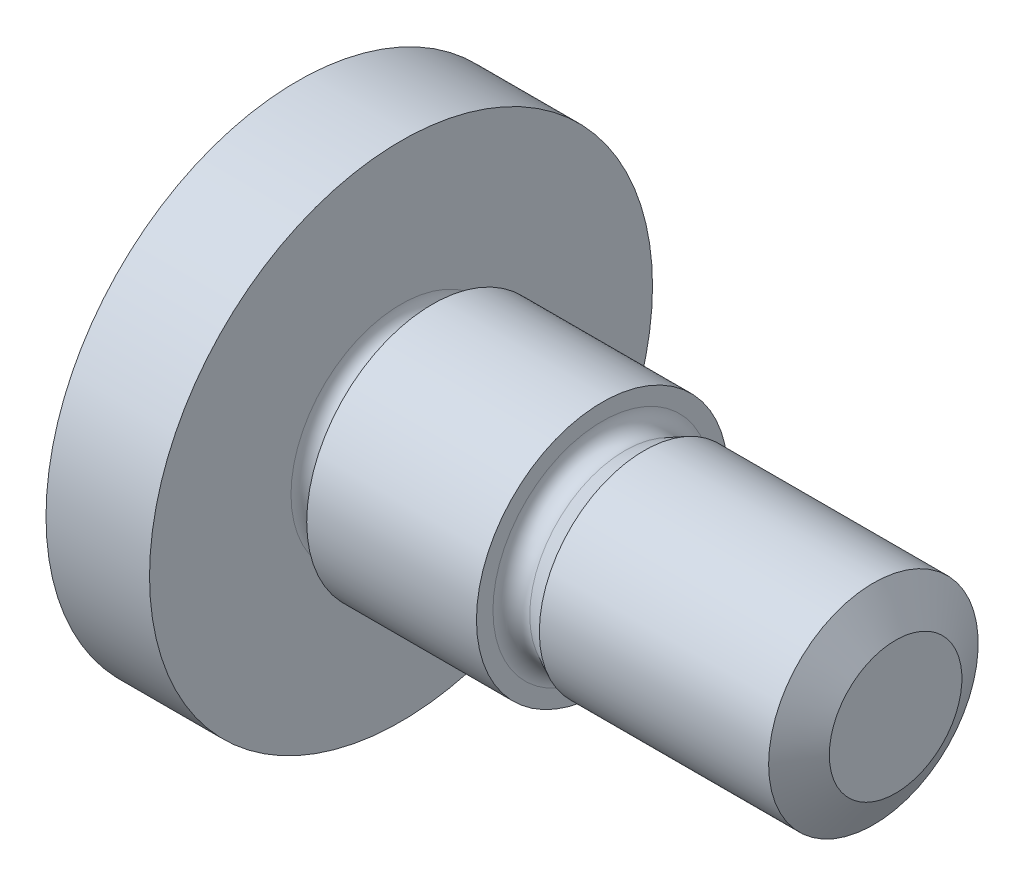
ISO-10303-21;
HEADER;
FILE_DESCRIPTION(('STEP AP214'),'2;1');
FILE_NAME('part.step','',(''),(''),'','','');
FILE_SCHEMA(('AUTOMOTIVE_DESIGN { 1 0 10303 214 1 1 1 1 }'));
ENDSEC;
DATA;
#1=APPLICATION_CONTEXT('core data for automotive mechanical design processes');
#2=APPLICATION_PROTOCOL_DEFINITION('international standard','automotive_design',2000,#1);
#3=PRODUCT_CONTEXT('',#1,'mechanical');
#4=PRODUCT('Part','Part','',(#3));
#5=PRODUCT_RELATED_PRODUCT_CATEGORY('part','',(#4));
#6=PRODUCT_DEFINITION_FORMATION('','',#4);
#7=PRODUCT_DEFINITION_CONTEXT('part definition',#1,'design');
#8=PRODUCT_DEFINITION('design','',#6,#7);
#9=PRODUCT_DEFINITION_SHAPE('','',#8);
#10=(LENGTH_UNIT() NAMED_UNIT(*) SI_UNIT(.MILLI.,.METRE.));
#11=(NAMED_UNIT(*) PLANE_ANGLE_UNIT() SI_UNIT($,.RADIAN.));
#12=(NAMED_UNIT(*) SI_UNIT($,.STERADIAN.) SOLID_ANGLE_UNIT());
#13=UNCERTAINTY_MEASURE_WITH_UNIT(LENGTH_MEASURE(1.E-05),#10,'distance_accuracy_value','');
#14=(GEOMETRIC_REPRESENTATION_CONTEXT(3) GLOBAL_UNCERTAINTY_ASSIGNED_CONTEXT((#13)) GLOBAL_UNIT_ASSIGNED_CONTEXT((#10,
#11,#12)) REPRESENTATION_CONTEXT('',''));
#15=CARTESIAN_POINT('',(0.,0.,0.));
#16=DIRECTION('',(0.,0.,1.));
#17=DIRECTION('',(1.,0.,0.));
#18=AXIS2_PLACEMENT_3D('',#15,#16,#17);
#19=CARTESIAN_POINT('',(0.,0.,0.));
#20=DIRECTION('',(1.,0.,0.));
#21=DIRECTION('',(0.,0.,-1.));
#22=AXIS2_PLACEMENT_3D('',#19,#20,#21);
#23=PLANE('',#22);
#24=DIRECTION('',(0.,0.5,0.866025403784439));
#25=VECTOR('',#24,1.);
#26=CARTESIAN_POINT('',(0.,-1.73205080756888,0.));
#27=LINE('',#26,#25);
#28=CARTESIAN_POINT('',(0.,-1.73205080756888,0.));
#29=VERTEX_POINT('',#28);
#30=CARTESIAN_POINT('',(0.,-0.866025403784439,1.5));
#31=VERTEX_POINT('',#30);
#32=EDGE_CURVE('E198',#29,#31,#27,.T.);
#33=ORIENTED_EDGE('',*,*,#32,.F.);
#34=DIRECTION('',(0.,-0.5,0.866025403784439));
#35=VECTOR('',#34,1.);
#36=CARTESIAN_POINT('',(0.,-0.866025403784438,-1.5));
#37=LINE('',#36,#35);
#38=CARTESIAN_POINT('',(0.,-0.866025403784438,-1.5));
#39=VERTEX_POINT('',#38);
#40=EDGE_CURVE('E50',#39,#29,#37,.T.);
#41=ORIENTED_EDGE('',*,*,#40,.F.);
#42=DIRECTION('',(0.,-1.,0.));
#43=VECTOR('',#42,1.);
#44=CARTESIAN_POINT('',(0.,0.86602540378444,-1.5));
#45=LINE('',#44,#43);
#46=CARTESIAN_POINT('',(0.,0.86602540378444,-1.5));
#47=VERTEX_POINT('',#46);
#48=EDGE_CURVE('E85',#47,#39,#45,.T.);
#49=ORIENTED_EDGE('',*,*,#48,.F.);
#50=DIRECTION('',(0.,-0.5,-0.866025403784439));
#51=VECTOR('',#50,1.);
#52=CARTESIAN_POINT('',(0.,1.73205080756888,0.));
#53=LINE('',#52,#51);
#54=CARTESIAN_POINT('',(0.,1.73205080756888,0.));
#55=VERTEX_POINT('',#54);
#56=EDGE_CURVE('E94',#55,#47,#53,.T.);
#57=ORIENTED_EDGE('',*,*,#56,.F.);
#58=DIRECTION('',(0.,0.5,-0.866025403784439));
#59=VECTOR('',#58,1.);
#60=CARTESIAN_POINT('',(0.,0.86602540378444,1.5));
#61=LINE('',#60,#59);
#62=CARTESIAN_POINT('',(0.,0.86602540378444,1.5));
#63=VERTEX_POINT('',#62);
#64=EDGE_CURVE('E100',#63,#55,#61,.T.);
#65=ORIENTED_EDGE('',*,*,#64,.F.);
#66=DIRECTION('',(0.,1.,0.));
#67=VECTOR('',#66,1.);
#68=CARTESIAN_POINT('',(0.,-0.866025403784439,1.5));
#69=LINE('',#68,#67);
#70=EDGE_CURVE('E231',#31,#63,#69,.T.);
#71=ORIENTED_EDGE('',*,*,#70,.F.);
#72=EDGE_LOOP('',(#33,#41,#49,#57,#65,#71));
#73=FACE_BOUND('',#72,.T.);
#74=CARTESIAN_POINT('',(0.,0.,0.));
#75=DIRECTION('',(-1.,0.,0.));
#76=DIRECTION('',(0.,0.,1.));
#77=AXIS2_PLACEMENT_3D('',#74,#75,#76);
#78=CIRCLE('',#77,5.0820130719885);
#79=CARTESIAN_POINT('',(0.,0.,5.0820130719885));
#80=VERTEX_POINT('',#79);
#81=EDGE_CURVE('E140',#80,#80,#78,.T.);
#82=ORIENTED_EDGE('',*,*,#81,.T.);
#83=EDGE_LOOP('',(#82));
#84=FACE_BOUND('',#83,.T.);
#85=ADVANCED_FACE('F34',(#73,#84),#23,.F.);
#86=CARTESIAN_POINT('',(0.53,0.,0.));
#87=DIRECTION('',(1.,0.,0.));
#88=DIRECTION('',(0.,0.,-1.));
#89=AXIS2_PLACEMENT_3D('',#86,#87,#88);
#90=CONICAL_SURFACE('',#89,6.,1.0471975511966);
#91=ORIENTED_EDGE('',*,*,#81,.F.);
#92=EDGE_LOOP('',(#91));
#93=FACE_BOUND('',#92,.T.);
#94=CARTESIAN_POINT('',(0.53,0.,0.));
#95=DIRECTION('',(-1.,0.,0.));
#96=DIRECTION('',(0.,0.,1.));
#97=AXIS2_PLACEMENT_3D('',#94,#95,#96);
#98=CIRCLE('',#97,6.);
#99=CARTESIAN_POINT('',(0.53,0.,6.));
#100=VERTEX_POINT('',#99);
#101=EDGE_CURVE('E137',#100,#100,#98,.T.);
#102=ORIENTED_EDGE('',*,*,#101,.T.);
#103=EDGE_LOOP('',(#102));
#104=FACE_BOUND('',#103,.T.);
#105=ADVANCED_FACE('F166',(#93,#104),#90,.T.);
#106=CARTESIAN_POINT('',(0.,0.,0.));
#107=DIRECTION('',(-1.,0.,0.));
#108=DIRECTION('',(0.,0.,1.));
#109=AXIS2_PLACEMENT_3D('',#106,#107,#108);
#110=CYLINDRICAL_SURFACE('',#109,6.);
#111=ORIENTED_EDGE('',*,*,#101,.F.);
#112=EDGE_LOOP('',(#111));
#113=FACE_BOUND('',#112,.T.);
#114=CARTESIAN_POINT('',(3.,0.,0.));
#115=DIRECTION('',(-1.,0.,0.));
#116=DIRECTION('',(0.,0.,1.));
#117=AXIS2_PLACEMENT_3D('',#114,#115,#116);
#118=CIRCLE('',#117,6.);
#119=CARTESIAN_POINT('',(3.,0.,6.));
#120=VERTEX_POINT('',#119);
#121=EDGE_CURVE('E134',#120,#120,#118,.T.);
#122=ORIENTED_EDGE('',*,*,#121,.T.);
#123=EDGE_LOOP('',(#122));
#124=FACE_BOUND('',#123,.T.);
#125=ADVANCED_FACE('F171',(#113,#124),#110,.T.);
#126=CARTESIAN_POINT('',(3.,6.,0.));
#127=DIRECTION('',(-1.,0.,0.));
#128=DIRECTION('',(0.,0.,1.));
#129=AXIS2_PLACEMENT_3D('',#126,#127,#128);
#130=PLANE('',#129);
#131=CARTESIAN_POINT('',(3.,0.,0.));
#132=DIRECTION('',(-1.,0.,0.));
#133=DIRECTION('',(0.,0.,1.));
#134=AXIS2_PLACEMENT_3D('',#131,#132,#133);
#135=CIRCLE('',#134,2.625);
#136=CARTESIAN_POINT('',(3.,0.,2.625));
#137=VERTEX_POINT('',#136);
#138=EDGE_CURVE('E143',#137,#137,#135,.T.);
#139=ORIENTED_EDGE('',*,*,#138,.T.);
#140=EDGE_LOOP('',(#139));
#141=FACE_BOUND('',#140,.T.);
#142=ORIENTED_EDGE('',*,*,#121,.F.);
#143=EDGE_LOOP('',(#142));
#144=FACE_BOUND('',#143,.T.);
#145=ADVANCED_FACE('F300',(#141,#144),#130,.F.);
#146=CARTESIAN_POINT('',(3.75,2.25,0.));
#147=DIRECTION('',(1.,0.,0.));
#148=DIRECTION('',(0.,0.,-1.));
#149=AXIS2_PLACEMENT_3D('',#146,#147,#148);
#150=PLANE('',#149);
#151=CARTESIAN_POINT('',(3.75,0.,0.));
#152=DIRECTION('',(1.,0.,0.));
#153=DIRECTION('',(0.,0.,-1.));
#154=AXIS2_PLACEMENT_3D('',#151,#152,#153);
#155=CIRCLE('',#154,2.625);
#156=CARTESIAN_POINT('',(3.75,0.,-2.625));
#157=VERTEX_POINT('',#156);
#158=EDGE_CURVE('E146',#157,#157,#155,.T.);
#159=ORIENTED_EDGE('',*,*,#158,.T.);
#160=EDGE_LOOP('',(#159));
#161=FACE_BOUND('',#160,.T.);
#162=CARTESIAN_POINT('',(3.75,0.,0.));
#163=DIRECTION('',(-1.,0.,0.));
#164=DIRECTION('',(0.,0.,1.));
#165=AXIS2_PLACEMENT_3D('',#162,#163,#164);
#166=CIRCLE('',#165,3.);
#167=CARTESIAN_POINT('',(3.75,0.,3.));
#168=VERTEX_POINT('',#167);
#169=EDGE_CURVE('E131',#168,#168,#166,.T.);
#170=ORIENTED_EDGE('',*,*,#169,.T.);
#171=EDGE_LOOP('',(#170));
#172=FACE_BOUND('',#171,.T.);
#173=ADVANCED_FACE('F296',(#161,#172),#150,.F.);
#174=CARTESIAN_POINT('',(0.,0.,0.));
#175=DIRECTION('',(-1.,0.,0.));
#176=DIRECTION('',(0.,0.,1.));
#177=AXIS2_PLACEMENT_3D('',#174,#175,#176);
#178=CYLINDRICAL_SURFACE('',#177,3.);
#179=ORIENTED_EDGE('',*,*,#169,.F.);
#180=EDGE_LOOP('',(#179));
#181=FACE_BOUND('',#180,.T.);
#182=CARTESIAN_POINT('',(7.8,0.,0.));
#183=DIRECTION('',(-1.,0.,0.));
#184=DIRECTION('',(0.,0.,1.));
#185=AXIS2_PLACEMENT_3D('',#182,#183,#184);
#186=CIRCLE('',#185,3.);
#187=CARTESIAN_POINT('',(7.8,0.,3.));
#188=VERTEX_POINT('',#187);
#189=EDGE_CURVE('E128',#188,#188,#186,.T.);
#190=ORIENTED_EDGE('',*,*,#189,.T.);
#191=EDGE_LOOP('',(#190));
#192=FACE_BOUND('',#191,.T.);
#193=ADVANCED_FACE('F293',(#181,#192),#178,.T.);
#194=CARTESIAN_POINT('',(7.8,3.,0.));
#195=DIRECTION('',(-1.,0.,0.));
#196=DIRECTION('',(0.,0.,1.));
#197=AXIS2_PLACEMENT_3D('',#194,#195,#196);
#198=PLANE('',#197);
#199=CARTESIAN_POINT('',(7.8,0.,0.));
#200=DIRECTION('',(-1.,0.,0.));
#201=DIRECTION('',(0.,0.,1.));
#202=AXIS2_PLACEMENT_3D('',#199,#200,#201);
#203=CIRCLE('',#202,2.60676274578121);
#204=CARTESIAN_POINT('',(7.8,0.,2.60676274578121));
#205=VERTEX_POINT('',#204);
#206=EDGE_CURVE('E43',#205,#205,#203,.T.);
#207=ORIENTED_EDGE('',*,*,#206,.T.);
#208=EDGE_LOOP('',(#207));
#209=FACE_BOUND('',#208,.T.);
#210=ORIENTED_EDGE('',*,*,#189,.F.);
#211=EDGE_LOOP('',(#210));
#212=FACE_BOUND('',#211,.T.);
#213=ADVANCED_FACE('F152',(#209,#212),#198,.F.);
#214=CARTESIAN_POINT('',(8.8,0.,0.));
#215=DIRECTION('',(1.,0.,0.));
#216=DIRECTION('',(0.,0.,-1.));
#217=AXIS2_PLACEMENT_3D('',#214,#215,#216);
#218=CONICAL_SURFACE('',#217,2.5,0.463647609000806);
#219=CARTESIAN_POINT('',(8.34270509831248,0.,0.));
#220=DIRECTION('',(1.,0.,0.));
#221=DIRECTION('',(0.,0.,-1.));
#222=AXIS2_PLACEMENT_3D('',#219,#220,#221);
#223=CIRCLE('',#222,2.27135254915624);
#224=CARTESIAN_POINT('',(8.34270509831248,0.,-2.27135254915624));
#225=VERTEX_POINT('',#224);
#226=EDGE_CURVE('E11',#225,#225,#223,.T.);
#227=ORIENTED_EDGE('',*,*,#226,.T.);
#228=EDGE_LOOP('',(#227));
#229=FACE_BOUND('',#228,.T.);
#230=CARTESIAN_POINT('',(8.8,0.,0.));
#231=DIRECTION('',(-1.,0.,0.));
#232=DIRECTION('',(0.,0.,1.));
#233=AXIS2_PLACEMENT_3D('',#230,#231,#232);
#234=CIRCLE('',#233,2.5);
#235=CARTESIAN_POINT('',(8.8,0.,2.5));
#236=VERTEX_POINT('',#235);
#237=EDGE_CURVE('E125',#236,#236,#234,.T.);
#238=ORIENTED_EDGE('',*,*,#237,.T.);
#239=EDGE_LOOP('',(#238));
#240=FACE_BOUND('',#239,.T.);
#241=ADVANCED_FACE('F286',(#229,#240),#218,.T.);
#242=CARTESIAN_POINT('',(0.,0.,0.));
#243=DIRECTION('',(-1.,0.,0.));
#244=DIRECTION('',(0.,0.,1.));
#245=AXIS2_PLACEMENT_3D('',#242,#243,#244);
#246=CYLINDRICAL_SURFACE('',#245,2.5);
#247=ORIENTED_EDGE('',*,*,#237,.F.);
#248=EDGE_LOOP('',(#247));
#249=FACE_BOUND('',#248,.T.);
#250=CARTESIAN_POINT('',(14.27,0.,0.));
#251=DIRECTION('',(-1.,0.,0.));
#252=DIRECTION('',(0.,0.,1.));
#253=AXIS2_PLACEMENT_3D('',#250,#251,#252);
#254=CIRCLE('',#253,2.5);
#255=CARTESIAN_POINT('',(14.27,0.,2.5));
#256=VERTEX_POINT('',#255);
#257=EDGE_CURVE('E122',#256,#256,#254,.T.);
#258=ORIENTED_EDGE('',*,*,#257,.T.);
#259=EDGE_LOOP('',(#258));
#260=FACE_BOUND('',#259,.T.);
#261=ADVANCED_FACE('F282',(#249,#260),#246,.T.);
#262=CARTESIAN_POINT('',(14.8,0.,0.));
#263=DIRECTION('',(-1.,0.,0.));
#264=DIRECTION('',(0.,0.,1.));
#265=AXIS2_PLACEMENT_3D('',#262,#263,#264);
#266=CONICAL_SURFACE('',#265,1.5820130719885,1.0471975511966);
#267=ORIENTED_EDGE('',*,*,#257,.F.);
#268=EDGE_LOOP('',(#267));
#269=FACE_BOUND('',#268,.T.);
#270=CARTESIAN_POINT('',(14.8,0.,0.));
#271=DIRECTION('',(-1.,0.,0.));
#272=DIRECTION('',(0.,0.,1.));
#273=AXIS2_PLACEMENT_3D('',#270,#271,#272);
#274=CIRCLE('',#273,1.5820130719885);
#275=CARTESIAN_POINT('',(14.8,0.,1.5820130719885));
#276=VERTEX_POINT('',#275);
#277=EDGE_CURVE('E111',#276,#276,#274,.T.);
#278=ORIENTED_EDGE('',*,*,#277,.T.);
#279=EDGE_LOOP('',(#278));
#280=FACE_BOUND('',#279,.T.);
#281=ADVANCED_FACE('F278',(#269,#280),#266,.T.);
#282=CARTESIAN_POINT('',(14.8,1.5820130719885,0.));
#283=DIRECTION('',(-1.,0.,0.));
#284=DIRECTION('',(0.,0.,1.));
#285=AXIS2_PLACEMENT_3D('',#282,#283,#284);
#286=PLANE('',#285);
#287=ORIENTED_EDGE('',*,*,#277,.F.);
#288=EDGE_LOOP('',(#287));
#289=FACE_BOUND('',#288,.T.);
#290=ADVANCED_FACE('F275',(#289),#286,.F.);
#291=CARTESIAN_POINT('',(3.,-0.866025403784438,-1.5));
#292=DIRECTION('',(0.,-0.866025403784438,-0.5));
#293=DIRECTION('',(0.,0.5,-0.866025403784439));
#294=AXIS2_PLACEMENT_3D('',#291,#292,#293);
#295=PLANE('',#294);
#296=ORIENTED_EDGE('',*,*,#40,.T.);
#297=DIRECTION('',(-1.,0.,0.));
#298=VECTOR('',#297,1.);
#299=CARTESIAN_POINT('',(3.,-1.73205080756888,0.));
#300=LINE('',#299,#298);
#301=CARTESIAN_POINT('',(3.,-1.73205080756888,0.));
#302=VERTEX_POINT('',#301);
#303=EDGE_CURVE('E118',#302,#29,#300,.T.);
#304=ORIENTED_EDGE('',*,*,#303,.F.);
#305=DIRECTION('',(0.,-0.5,0.866025403784439));
#306=VECTOR('',#305,1.);
#307=CARTESIAN_POINT('',(3.,-0.866025403784438,-1.5));
#308=LINE('',#307,#306);
#309=CARTESIAN_POINT('',(3.,-0.866025403784439,-1.5));
#310=VERTEX_POINT('',#309);
#311=EDGE_CURVE('E104',#310,#302,#308,.T.);
#312=ORIENTED_EDGE('',*,*,#311,.F.);
#313=DIRECTION('',(-1.,0.,0.));
#314=VECTOR('',#313,1.);
#315=CARTESIAN_POINT('',(3.,-0.866025403784438,-1.5));
#316=LINE('',#315,#314);
#317=EDGE_CURVE('E90',#310,#39,#316,.T.);
#318=ORIENTED_EDGE('',*,*,#317,.T.);
#319=EDGE_LOOP('',(#296,#304,#312,#318));
#320=FACE_BOUND('',#319,.T.);
#321=ADVANCED_FACE('F211',(#320),#295,.F.);
#322=CARTESIAN_POINT('',(3.,0.86602540378444,-1.5));
#323=DIRECTION('',(0.,0.,-1.));
#324=DIRECTION('',(-1.,0.,0.));
#325=AXIS2_PLACEMENT_3D('',#322,#323,#324);
#326=PLANE('',#325);
#327=ORIENTED_EDGE('',*,*,#48,.T.);
#328=ORIENTED_EDGE('',*,*,#317,.F.);
#329=DIRECTION('',(0.,-1.,0.));
#330=VECTOR('',#329,1.);
#331=CARTESIAN_POINT('',(3.,0.86602540378444,-1.5));
#332=LINE('',#331,#330);
#333=CARTESIAN_POINT('',(3.,0.86602540378444,-1.5));
#334=VERTEX_POINT('',#333);
#335=EDGE_CURVE('E87',#334,#310,#332,.T.);
#336=ORIENTED_EDGE('',*,*,#335,.F.);
#337=DIRECTION('',(-1.,0.,0.));
#338=VECTOR('',#337,1.);
#339=CARTESIAN_POINT('',(3.,0.86602540378444,-1.5));
#340=LINE('',#339,#338);
#341=EDGE_CURVE('E80',#334,#47,#340,.T.);
#342=ORIENTED_EDGE('',*,*,#341,.T.);
#343=EDGE_LOOP('',(#327,#328,#336,#342));
#344=FACE_BOUND('',#343,.T.);
#345=ADVANCED_FACE('F82',(#344),#326,.F.);
#346=CARTESIAN_POINT('',(3.,1.73205080756888,0.));
#347=DIRECTION('',(0.,0.866025403784439,-0.5));
#348=DIRECTION('',(0.,0.5,0.866025403784439));
#349=AXIS2_PLACEMENT_3D('',#346,#347,#348);
#350=PLANE('',#349);
#351=ORIENTED_EDGE('',*,*,#56,.T.);
#352=ORIENTED_EDGE('',*,*,#341,.F.);
#353=DIRECTION('',(0.,-0.5,-0.866025403784439));
#354=VECTOR('',#353,1.);
#355=CARTESIAN_POINT('',(3.,1.73205080756888,0.));
#356=LINE('',#355,#354);
#357=CARTESIAN_POINT('',(3.,1.73205080756888,0.));
#358=VERTEX_POINT('',#357);
#359=EDGE_CURVE('E226',#358,#334,#356,.T.);
#360=ORIENTED_EDGE('',*,*,#359,.F.);
#361=DIRECTION('',(-1.,0.,0.));
#362=VECTOR('',#361,1.);
#363=CARTESIAN_POINT('',(3.,1.73205080756888,0.));
#364=LINE('',#363,#362);
#365=EDGE_CURVE('E91',#358,#55,#364,.T.);
#366=ORIENTED_EDGE('',*,*,#365,.T.);
#367=EDGE_LOOP('',(#351,#352,#360,#366));
#368=FACE_BOUND('',#367,.T.);
#369=ADVANCED_FACE('F95',(#368),#350,.F.);
#370=CARTESIAN_POINT('',(3.,0.86602540378444,1.5));
#371=DIRECTION('',(0.,0.866025403784439,0.5));
#372=DIRECTION('',(0.,-0.5,0.866025403784439));
#373=AXIS2_PLACEMENT_3D('',#370,#371,#372);
#374=PLANE('',#373);
#375=ORIENTED_EDGE('',*,*,#64,.T.);
#376=ORIENTED_EDGE('',*,*,#365,.F.);
#377=DIRECTION('',(0.,0.5,-0.866025403784439));
#378=VECTOR('',#377,1.);
#379=CARTESIAN_POINT('',(3.,0.86602540378444,1.5));
#380=LINE('',#379,#378);
#381=CARTESIAN_POINT('',(3.,0.866025403784442,1.5));
#382=VERTEX_POINT('',#381);
#383=EDGE_CURVE('E221',#382,#358,#380,.T.);
#384=ORIENTED_EDGE('',*,*,#383,.F.);
#385=DIRECTION('',(-1.,0.,0.));
#386=VECTOR('',#385,1.);
#387=CARTESIAN_POINT('',(3.,0.86602540378444,1.5));
#388=LINE('',#387,#386);
#389=EDGE_CURVE('E114',#382,#63,#388,.T.);
#390=ORIENTED_EDGE('',*,*,#389,.T.);
#391=EDGE_LOOP('',(#375,#376,#384,#390));
#392=FACE_BOUND('',#391,.T.);
#393=ADVANCED_FACE('F234',(#392),#374,.F.);
#394=CARTESIAN_POINT('',(3.,-0.866025403784439,1.5));
#395=DIRECTION('',(0.,0.,1.));
#396=DIRECTION('',(1.,0.,0.));
#397=AXIS2_PLACEMENT_3D('',#394,#395,#396);
#398=PLANE('',#397);
#399=ORIENTED_EDGE('',*,*,#70,.T.);
#400=ORIENTED_EDGE('',*,*,#389,.F.);
#401=DIRECTION('',(0.,1.,0.));
#402=VECTOR('',#401,1.);
#403=CARTESIAN_POINT('',(3.,-0.866025403784439,1.5));
#404=LINE('',#403,#402);
#405=CARTESIAN_POINT('',(3.,-0.86602540378444,1.5));
#406=VERTEX_POINT('',#405);
#407=EDGE_CURVE('E218',#406,#382,#404,.T.);
#408=ORIENTED_EDGE('',*,*,#407,.F.);
#409=DIRECTION('',(-1.,0.,0.));
#410=VECTOR('',#409,1.);
#411=CARTESIAN_POINT('',(3.,-0.866025403784439,1.5));
#412=LINE('',#411,#410);
#413=EDGE_CURVE('E116',#406,#31,#412,.T.);
#414=ORIENTED_EDGE('',*,*,#413,.T.);
#415=EDGE_LOOP('',(#399,#400,#408,#414));
#416=FACE_BOUND('',#415,.T.);
#417=ADVANCED_FACE('F239',(#416),#398,.F.);
#418=CARTESIAN_POINT('',(3.,-1.73205080756888,0.));
#419=DIRECTION('',(0.,-0.866025403784439,0.5));
#420=DIRECTION('',(0.,-0.5,-0.866025403784439));
#421=AXIS2_PLACEMENT_3D('',#418,#419,#420);
#422=PLANE('',#421);
#423=ORIENTED_EDGE('',*,*,#32,.T.);
#424=ORIENTED_EDGE('',*,*,#413,.F.);
#425=DIRECTION('',(0.,0.5,0.866025403784439));
#426=VECTOR('',#425,1.);
#427=CARTESIAN_POINT('',(3.,-1.73205080756888,0.));
#428=LINE('',#427,#426);
#429=EDGE_CURVE('E107',#302,#406,#428,.T.);
#430=ORIENTED_EDGE('',*,*,#429,.F.);
#431=ORIENTED_EDGE('',*,*,#303,.T.);
#432=EDGE_LOOP('',(#423,#424,#430,#431));
#433=FACE_BOUND('',#432,.T.);
#434=ADVANCED_FACE('F215',(#433),#422,.F.);
#435=CARTESIAN_POINT('',(3.,0.,0.));
#436=DIRECTION('',(1.,0.,0.));
#437=DIRECTION('',(0.,0.,-1.));
#438=AXIS2_PLACEMENT_3D('',#435,#436,#437);
#439=PLANE('',#438);
#440=ORIENTED_EDGE('',*,*,#311,.T.);
#441=CARTESIAN_POINT('',(3.,0.,0.));
#442=DIRECTION('',(-1.,0.,0.));
#443=DIRECTION('',(0.,0.,1.));
#444=AXIS2_PLACEMENT_3D('',#441,#442,#443);
#445=CIRCLE('',#444,1.73205080756888);
#446=EDGE_CURVE('E196',#310,#302,#445,.T.);
#447=ORIENTED_EDGE('',*,*,#446,.F.);
#448=EDGE_LOOP('',(#440,#447));
#449=FACE_BOUND('',#448,.T.);
#450=ADVANCED_FACE('F258',(#449),#439,.T.);
#451=ORIENTED_EDGE('',*,*,#429,.T.);
#452=EDGE_CURVE('E189',#302,#406,#445,.T.);
#453=ORIENTED_EDGE('',*,*,#452,.F.);
#454=EDGE_LOOP('',(#451,#453));
#455=FACE_BOUND('',#454,.T.);
#456=ADVANCED_FACE('F262',(#455),#439,.T.);
#457=ORIENTED_EDGE('',*,*,#407,.T.);
#458=EDGE_CURVE('E187',#406,#382,#445,.T.);
#459=ORIENTED_EDGE('',*,*,#458,.F.);
#460=EDGE_LOOP('',(#457,#459));
#461=FACE_BOUND('',#460,.T.);
#462=ADVANCED_FACE('F241',(#461),#439,.T.);
#463=ORIENTED_EDGE('',*,*,#383,.T.);
#464=EDGE_CURVE('E191',#382,#358,#445,.T.);
#465=ORIENTED_EDGE('',*,*,#464,.F.);
#466=EDGE_LOOP('',(#463,#465));
#467=FACE_BOUND('',#466,.T.);
#468=ADVANCED_FACE('F252',(#467),#439,.T.);
#469=ORIENTED_EDGE('',*,*,#359,.T.);
#470=EDGE_CURVE('E59',#358,#334,#445,.T.);
#471=ORIENTED_EDGE('',*,*,#470,.F.);
#472=EDGE_LOOP('',(#469,#471));
#473=FACE_BOUND('',#472,.T.);
#474=ADVANCED_FACE('F250',(#473),#439,.T.);
#475=ORIENTED_EDGE('',*,*,#335,.T.);
#476=EDGE_CURVE('E200',#334,#310,#445,.T.);
#477=ORIENTED_EDGE('',*,*,#476,.F.);
#478=EDGE_LOOP('',(#475,#477));
#479=FACE_BOUND('',#478,.T.);
#480=ADVANCED_FACE('F181',(#479),#439,.T.);
#481=CARTESIAN_POINT('',(3.8076685558829,0.,0.));
#482=DIRECTION('',(-1.,0.,0.));
#483=DIRECTION('',(0.,0.,1.));
#484=AXIS2_PLACEMENT_3D('',#481,#482,#483);
#485=CONICAL_SURFACE('',#484,0.,1.13446401379632);
#486=ORIENTED_EDGE('',*,*,#464,.T.);
#487=ORIENTED_EDGE('',*,*,#470,.T.);
#488=ORIENTED_EDGE('',*,*,#476,.T.);
#489=ORIENTED_EDGE('',*,*,#446,.T.);
#490=ORIENTED_EDGE('',*,*,#452,.T.);
#491=ORIENTED_EDGE('',*,*,#458,.T.);
#492=EDGE_LOOP('',(#486,#487,#488,#489,#490,#491));
#493=FACE_BOUND('',#492,.T.);
#494=CARTESIAN_POINT('',(3.8076685558829,0.,0.));
#495=VERTEX_POINT('',#494);
#496=VERTEX_LOOP('',#495);
#497=FACE_BOUND('',#496,.T.);
#498=ADVANCED_FACE('F176',(#493,#497),#485,.F.);
#499=CARTESIAN_POINT('',(3.375,0.,0.));
#500=DIRECTION('',(1.,0.,0.));
#501=DIRECTION('',(0.,0.,-1.));
#502=AXIS2_PLACEMENT_3D('',#499,#500,#501);
#503=TOROIDAL_SURFACE('',#502,2.625,0.375);
#504=ORIENTED_EDGE('',*,*,#158,.F.);
#505=EDGE_LOOP('',(#504));
#506=FACE_BOUND('',#505,.T.);
#507=CARTESIAN_POINT('',(3.375,0.,0.));
#508=DIRECTION('',(1.,0.,0.));
#509=DIRECTION('',(0.,0.,-1.));
#510=AXIS2_PLACEMENT_3D('',#507,#508,#509);
#511=CIRCLE('',#510,2.25);
#512=CARTESIAN_POINT('',(3.375,0.,-2.25));
#513=VERTEX_POINT('',#512);
#514=EDGE_CURVE('E38',#513,#513,#511,.F.);
#515=ORIENTED_EDGE('',*,*,#514,.F.);
#516=EDGE_LOOP('',(#515));
#517=FACE_BOUND('',#516,.T.);
#518=ADVANCED_FACE('F161',(#506,#517),#503,.F.);
#519=CARTESIAN_POINT('',(3.375,0.,0.));
#520=DIRECTION('',(-1.,0.,0.));
#521=DIRECTION('',(0.,0.,1.));
#522=AXIS2_PLACEMENT_3D('',#519,#520,#521);
#523=TOROIDAL_SURFACE('',#522,2.625,0.375);
#524=ORIENTED_EDGE('',*,*,#514,.T.);
#525=EDGE_LOOP('',(#524));
#526=FACE_BOUND('',#525,.T.);
#527=ORIENTED_EDGE('',*,*,#138,.F.);
#528=EDGE_LOOP('',(#527));
#529=FACE_BOUND('',#528,.T.);
#530=ADVANCED_FACE('F156',(#526,#529),#523,.F.);
#531=CARTESIAN_POINT('',(8.175,0.,0.));
#532=DIRECTION('',(-1.,0.,0.));
#533=DIRECTION('',(0.,0.,1.));
#534=AXIS2_PLACEMENT_3D('',#531,#532,#533);
#535=TOROIDAL_SURFACE('',#534,2.60676274578121,0.375);
#536=ORIENTED_EDGE('',*,*,#226,.F.);
#537=EDGE_LOOP('',(#536));
#538=FACE_BOUND('',#537,.T.);
#539=ORIENTED_EDGE('',*,*,#206,.F.);
#540=EDGE_LOOP('',(#539));
#541=FACE_BOUND('',#540,.T.);
#542=ADVANCED_FACE('F36',(#538,#541),#535,.F.);
#543=CLOSED_SHELL('',(#85,#105,#125,#145,#173,#193,#213,#241,#261,#281,#290,#321,#345,#369,#393,
#417,#434,#450,#456,#462,#468,#474,#480,#498,#518,#530,#542));
#544=MANIFOLD_SOLID_BREP('B2',#543);
#545=ADVANCED_BREP_SHAPE_REPRESENTATION('',(#18,#544),#14);
#546=SHAPE_DEFINITION_REPRESENTATION(#9,#545);
ENDSEC;
END-ISO-10303-21;
